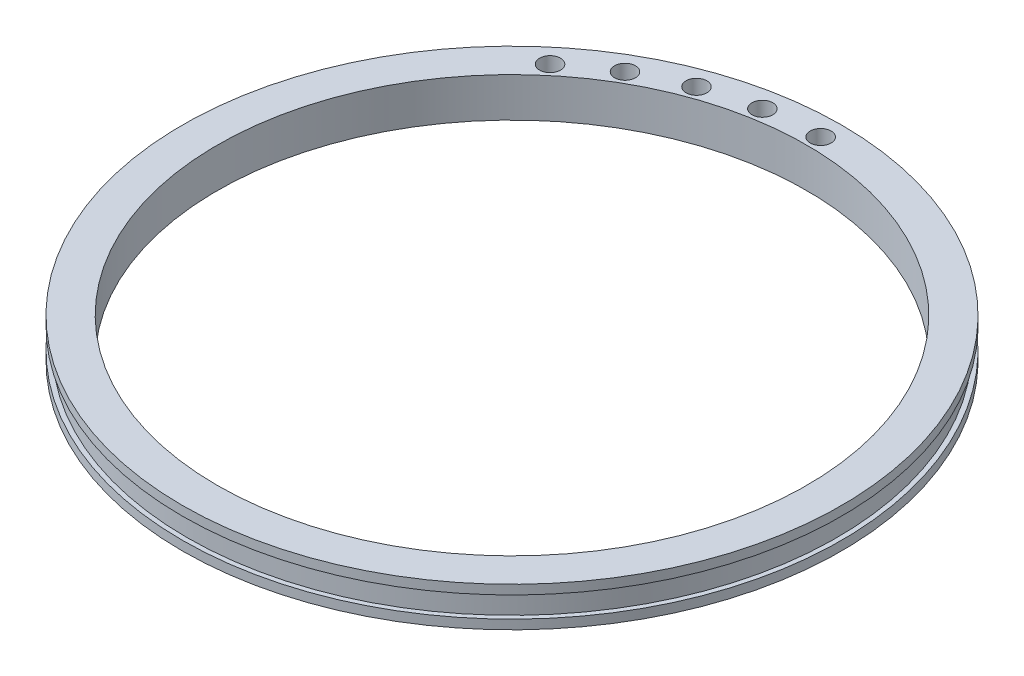
ISO-10303-21;
HEADER;
FILE_DESCRIPTION(('STEP AP214'),'2;1');
FILE_NAME('part.step','',(''),(''),'','','');
FILE_SCHEMA(('AUTOMOTIVE_DESIGN { 1 0 10303 214 1 1 1 1 }'));
ENDSEC;
DATA;
#1=APPLICATION_CONTEXT('core data for automotive mechanical design processes');
#2=APPLICATION_PROTOCOL_DEFINITION('international standard','automotive_design',2000,#1);
#3=PRODUCT_CONTEXT('',#1,'mechanical');
#4=PRODUCT('Part','Part','',(#3));
#5=PRODUCT_RELATED_PRODUCT_CATEGORY('part','',(#4));
#6=PRODUCT_DEFINITION_FORMATION('','',#4);
#7=PRODUCT_DEFINITION_CONTEXT('part definition',#1,'design');
#8=PRODUCT_DEFINITION('design','',#6,#7);
#9=PRODUCT_DEFINITION_SHAPE('','',#8);
#10=(LENGTH_UNIT() NAMED_UNIT(*) SI_UNIT(.MILLI.,.METRE.));
#11=(NAMED_UNIT(*) PLANE_ANGLE_UNIT() SI_UNIT($,.RADIAN.));
#12=(NAMED_UNIT(*) SI_UNIT($,.STERADIAN.) SOLID_ANGLE_UNIT());
#13=UNCERTAINTY_MEASURE_WITH_UNIT(LENGTH_MEASURE(1.E-05),#10,'distance_accuracy_value','');
#14=(GEOMETRIC_REPRESENTATION_CONTEXT(3) GLOBAL_UNCERTAINTY_ASSIGNED_CONTEXT((#13)) GLOBAL_UNIT_ASSIGNED_CONTEXT((#10,
#11,#12)) REPRESENTATION_CONTEXT('',''));
#15=CARTESIAN_POINT('',(0.,0.,0.));
#16=DIRECTION('',(0.,0.,1.));
#17=DIRECTION('',(1.,0.,0.));
#18=AXIS2_PLACEMENT_3D('',#15,#16,#17);
#19=CARTESIAN_POINT('',(0.,2.25,0.));
#20=DIRECTION('',(0.,-1.,0.));
#21=DIRECTION('',(0.,0.,-1.));
#22=AXIS2_PLACEMENT_3D('',#19,#20,#21);
#23=CYLINDRICAL_SURFACE('',#22,70.);
#24=CARTESIAN_POINT('',(0.,2.25,0.));
#25=DIRECTION('',(0.,1.,0.));
#26=DIRECTION('',(0.,0.,1.));
#27=AXIS2_PLACEMENT_3D('',#24,#25,#26);
#28=CIRCLE('',#27,70.);
#29=CARTESIAN_POINT('',(0.,2.25,70.));
#30=VERTEX_POINT('',#29);
#31=EDGE_CURVE('E10',#30,#30,#28,.T.);
#32=ORIENTED_EDGE('',*,*,#31,.F.);
#33=EDGE_LOOP('',(#32));
#34=FACE_BOUND('',#33,.T.);
#35=CARTESIAN_POINT('',(0.,-2.25,0.));
#36=DIRECTION('',(0.,1.,0.));
#37=DIRECTION('',(0.,0.,1.));
#38=AXIS2_PLACEMENT_3D('',#35,#36,#37);
#39=CIRCLE('',#38,70.);
#40=CARTESIAN_POINT('',(0.,-2.25,70.));
#41=VERTEX_POINT('',#40);
#42=EDGE_CURVE('E34',#41,#41,#39,.T.);
#43=ORIENTED_EDGE('',*,*,#42,.T.);
#44=EDGE_LOOP('',(#43));
#45=FACE_BOUND('',#44,.T.);
#46=ADVANCED_FACE('F31',(#34,#45),#23,.T.);
#47=CARTESIAN_POINT('',(0.,4.25,0.));
#48=DIRECTION('',(0.,-1.,0.));
#49=DIRECTION('',(0.,0.,-1.));
#50=AXIS2_PLACEMENT_3D('',#47,#48,#49);
#51=CYLINDRICAL_SURFACE('',#50,71.);
#52=CARTESIAN_POINT('',(0.,4.25,0.));
#53=DIRECTION('',(0.,1.,0.));
#54=DIRECTION('',(0.,0.,1.));
#55=AXIS2_PLACEMENT_3D('',#52,#53,#54);
#56=CIRCLE('',#55,71.);
#57=CARTESIAN_POINT('',(0.,4.25,71.));
#58=VERTEX_POINT('',#57);
#59=EDGE_CURVE('E38',#58,#58,#56,.T.);
#60=ORIENTED_EDGE('',*,*,#59,.F.);
#61=EDGE_LOOP('',(#60));
#62=FACE_BOUND('',#61,.T.);
#63=CARTESIAN_POINT('',(0.,2.25,0.));
#64=DIRECTION('',(0.,1.,0.));
#65=DIRECTION('',(0.,0.,1.));
#66=AXIS2_PLACEMENT_3D('',#63,#64,#65);
#67=CIRCLE('',#66,71.);
#68=CARTESIAN_POINT('',(0.,2.25,71.));
#69=VERTEX_POINT('',#68);
#70=EDGE_CURVE('E42',#69,#69,#67,.T.);
#71=ORIENTED_EDGE('',*,*,#70,.T.);
#72=EDGE_LOOP('',(#71));
#73=FACE_BOUND('',#72,.T.);
#74=ADVANCED_FACE('F96',(#62,#73),#51,.T.);
#75=CARTESIAN_POINT('',(0.,4.25,0.));
#76=DIRECTION('',(0.,1.,0.));
#77=DIRECTION('',(0.,0.,1.));
#78=AXIS2_PLACEMENT_3D('',#75,#76,#77);
#79=PLANE('',#78);
#80=CARTESIAN_POINT('',(-11.5476038148509,4.25,-65.4897155753118));
#81=DIRECTION('',(0.,1.,0.));
#82=DIRECTION('',(0.173648177666931,0.,0.984807753012208));
#83=AXIS2_PLACEMENT_3D('',#80,#81,#82);
#84=CIRCLE('',#83,2.25);
#85=CARTESIAN_POINT('',(-11.1568954151003,4.25,-63.2738981310344));
#86=VERTEX_POINT('',#85);
#87=EDGE_CURVE('E82',#86,#86,#84,.T.);
#88=ORIENTED_EDGE('',*,*,#87,.F.);
#89=EDGE_LOOP('',(#88));
#90=FACE_BOUND('',#89,.T.);
#91=CARTESIAN_POINT('',(-22.744339531157,4.25,-62.4895592822629));
#92=DIRECTION('',(0.,1.,0.));
#93=DIRECTION('',(0.342020143325669,0.,0.939692620785908));
#94=AXIS2_PLACEMENT_3D('',#91,#92,#93);
#95=CIRCLE('',#94,2.25);
#96=CARTESIAN_POINT('',(-21.9747942086743,4.25,-60.3752508854946));
#97=VERTEX_POINT('',#96);
#98=EDGE_CURVE('E76',#97,#97,#95,.T.);
#99=ORIENTED_EDGE('',*,*,#98,.F.);
#100=EDGE_LOOP('',(#99));
#101=FACE_BOUND('',#100,.T.);
#102=CARTESIAN_POINT('',(-33.2500000000001,4.25,-57.5906893516651));
#103=DIRECTION('',(0.,1.,0.));
#104=DIRECTION('',(0.500000000000001,0.,0.866025403784438));
#105=AXIS2_PLACEMENT_3D('',#102,#103,#104);
#106=CIRCLE('',#105,2.25);
#107=CARTESIAN_POINT('',(-32.1250000000001,4.25,-55.6421321931501));
#108=VERTEX_POINT('',#107);
#109=EDGE_CURVE('E69',#108,#108,#106,.T.);
#110=ORIENTED_EDGE('',*,*,#109,.F.);
#111=EDGE_LOOP('',(#110));
#112=FACE_BOUND('',#111,.T.);
#113=CARTESIAN_POINT('',(-42.745376044155,4.25,-50.941955467412));
#114=DIRECTION('',(0.,1.,0.));
#115=DIRECTION('',(0.642787609686541,0.,0.766044443118977));
#116=AXIS2_PLACEMENT_3D('',#113,#114,#115);
#117=CIRCLE('',#116,2.25);
#118=CARTESIAN_POINT('',(-41.2991039223602,4.25,-49.2183554703943));
#119=VERTEX_POINT('',#118);
#120=EDGE_CURVE('E70',#119,#119,#117,.T.);
#121=ORIENTED_EDGE('',*,*,#120,.F.);
#122=EDGE_LOOP('',(#121));
#123=FACE_BOUND('',#122,.T.);
#124=CARTESIAN_POINT('',(0.,4.25,-66.5));
#125=DIRECTION('',(0.,1.,0.));
#126=DIRECTION('',(0.,0.,1.));
#127=AXIS2_PLACEMENT_3D('',#124,#125,#126);
#128=CIRCLE('',#127,2.25);
#129=CARTESIAN_POINT('',(0.,4.25,-64.25));
#130=VERTEX_POINT('',#129);
#131=EDGE_CURVE('E62',#130,#130,#128,.T.);
#132=ORIENTED_EDGE('',*,*,#131,.F.);
#133=EDGE_LOOP('',(#132));
#134=FACE_BOUND('',#133,.T.);
#135=CARTESIAN_POINT('',(0.,4.25,0.));
#136=DIRECTION('',(0.,1.,0.));
#137=DIRECTION('',(0.,0.,1.));
#138=AXIS2_PLACEMENT_3D('',#135,#136,#137);
#139=CIRCLE('',#138,63.5);
#140=CARTESIAN_POINT('',(0.,4.25,63.5));
#141=VERTEX_POINT('',#140);
#142=EDGE_CURVE('E51',#141,#141,#139,.T.);
#143=ORIENTED_EDGE('',*,*,#142,.F.);
#144=EDGE_LOOP('',(#143));
#145=FACE_BOUND('',#144,.T.);
#146=ORIENTED_EDGE('',*,*,#59,.T.);
#147=EDGE_LOOP('',(#146));
#148=FACE_BOUND('',#147,.T.);
#149=ADVANCED_FACE('F92',(#90,#101,#112,#123,#134,#145,#148),#79,.T.);
#150=CARTESIAN_POINT('',(0.,2.25,0.));
#151=DIRECTION('',(0.,1.,0.));
#152=DIRECTION('',(0.,0.,1.));
#153=AXIS2_PLACEMENT_3D('',#150,#151,#152);
#154=PLANE('',#153);
#155=ORIENTED_EDGE('',*,*,#31,.T.);
#156=EDGE_LOOP('',(#155));
#157=FACE_BOUND('',#156,.T.);
#158=ORIENTED_EDGE('',*,*,#70,.F.);
#159=EDGE_LOOP('',(#158));
#160=FACE_BOUND('',#159,.T.);
#161=ADVANCED_FACE('F95',(#157,#160),#154,.F.);
#162=CARTESIAN_POINT('',(0.,-4.25,0.));
#163=DIRECTION('',(0.,1.,0.));
#164=DIRECTION('',(0.,0.,1.));
#165=AXIS2_PLACEMENT_3D('',#162,#163,#164);
#166=CYLINDRICAL_SURFACE('',#165,71.);
#167=CARTESIAN_POINT('',(0.,-4.25,0.));
#168=DIRECTION('',(0.,1.,0.));
#169=DIRECTION('',(0.,0.,1.));
#170=AXIS2_PLACEMENT_3D('',#167,#168,#169);
#171=CIRCLE('',#170,71.);
#172=CARTESIAN_POINT('',(0.,-4.25,71.));
#173=VERTEX_POINT('',#172);
#174=EDGE_CURVE('E50',#173,#173,#171,.T.);
#175=ORIENTED_EDGE('',*,*,#174,.T.);
#176=EDGE_LOOP('',(#175));
#177=FACE_BOUND('',#176,.T.);
#178=CARTESIAN_POINT('',(0.,-2.25,0.));
#179=DIRECTION('',(0.,1.,0.));
#180=DIRECTION('',(0.,0.,1.));
#181=AXIS2_PLACEMENT_3D('',#178,#179,#180);
#182=CIRCLE('',#181,71.);
#183=CARTESIAN_POINT('',(0.,-2.25,71.));
#184=VERTEX_POINT('',#183);
#185=EDGE_CURVE('E47',#184,#184,#182,.T.);
#186=ORIENTED_EDGE('',*,*,#185,.F.);
#187=EDGE_LOOP('',(#186));
#188=FACE_BOUND('',#187,.T.);
#189=ADVANCED_FACE('F115',(#177,#188),#166,.T.);
#190=CARTESIAN_POINT('',(0.,-4.25,0.));
#191=DIRECTION('',(0.,-1.,0.));
#192=DIRECTION('',(0.,0.,1.));
#193=AXIS2_PLACEMENT_3D('',#190,#191,#192);
#194=PLANE('',#193);
#195=CARTESIAN_POINT('',(-11.5476038148509,-4.25,-65.4897155753118));
#196=DIRECTION('',(0.,1.,0.));
#197=DIRECTION('',(0.173648177666931,0.,0.984807753012208));
#198=AXIS2_PLACEMENT_3D('',#195,#196,#197);
#199=CIRCLE('',#198,2.25);
#200=CARTESIAN_POINT('',(-11.1568954151003,-4.25,-63.2738981310344));
#201=VERTEX_POINT('',#200);
#202=EDGE_CURVE('E65',#201,#201,#199,.T.);
#203=ORIENTED_EDGE('',*,*,#202,.T.);
#204=EDGE_LOOP('',(#203));
#205=FACE_BOUND('',#204,.T.);
#206=CARTESIAN_POINT('',(-22.744339531157,-4.25,-62.4895592822629));
#207=DIRECTION('',(0.,1.,0.));
#208=DIRECTION('',(0.342020143325669,0.,0.939692620785908));
#209=AXIS2_PLACEMENT_3D('',#206,#207,#208);
#210=CIRCLE('',#209,2.25);
#211=CARTESIAN_POINT('',(-21.9747942086743,-4.25,-60.3752508854946));
#212=VERTEX_POINT('',#211);
#213=EDGE_CURVE('E79',#212,#212,#210,.T.);
#214=ORIENTED_EDGE('',*,*,#213,.T.);
#215=EDGE_LOOP('',(#214));
#216=FACE_BOUND('',#215,.T.);
#217=CARTESIAN_POINT('',(-33.2500000000001,-4.25,-57.5906893516651));
#218=DIRECTION('',(0.,1.,0.));
#219=DIRECTION('',(0.500000000000001,0.,0.866025403784438));
#220=AXIS2_PLACEMENT_3D('',#217,#218,#219);
#221=CIRCLE('',#220,2.25);
#222=CARTESIAN_POINT('',(-32.1250000000001,-4.25,-55.6421321931501));
#223=VERTEX_POINT('',#222);
#224=EDGE_CURVE('E73',#223,#223,#221,.T.);
#225=ORIENTED_EDGE('',*,*,#224,.T.);
#226=EDGE_LOOP('',(#225));
#227=FACE_BOUND('',#226,.T.);
#228=CARTESIAN_POINT('',(-42.745376044155,-4.25,-50.941955467412));
#229=DIRECTION('',(0.,1.,0.));
#230=DIRECTION('',(0.642787609686541,0.,0.766044443118977));
#231=AXIS2_PLACEMENT_3D('',#228,#229,#230);
#232=CIRCLE('',#231,2.25);
#233=CARTESIAN_POINT('',(-41.2991039223602,-4.25,-49.2183554703943));
#234=VERTEX_POINT('',#233);
#235=EDGE_CURVE('E66',#234,#234,#232,.T.);
#236=ORIENTED_EDGE('',*,*,#235,.T.);
#237=EDGE_LOOP('',(#236));
#238=FACE_BOUND('',#237,.T.);
#239=CARTESIAN_POINT('',(0.,-4.25,-66.5));
#240=DIRECTION('',(0.,1.,0.));
#241=DIRECTION('',(0.,0.,1.));
#242=AXIS2_PLACEMENT_3D('',#239,#240,#241);
#243=CIRCLE('',#242,2.25);
#244=CARTESIAN_POINT('',(0.,-4.25,-64.25));
#245=VERTEX_POINT('',#244);
#246=EDGE_CURVE('E59',#245,#245,#243,.T.);
#247=ORIENTED_EDGE('',*,*,#246,.T.);
#248=EDGE_LOOP('',(#247));
#249=FACE_BOUND('',#248,.T.);
#250=CARTESIAN_POINT('',(0.,-4.25,0.));
#251=DIRECTION('',(0.,1.,0.));
#252=DIRECTION('',(0.,0.,1.));
#253=AXIS2_PLACEMENT_3D('',#250,#251,#252);
#254=CIRCLE('',#253,63.5);
#255=CARTESIAN_POINT('',(0.,-4.25,63.5));
#256=VERTEX_POINT('',#255);
#257=EDGE_CURVE('E56',#256,#256,#254,.T.);
#258=ORIENTED_EDGE('',*,*,#257,.T.);
#259=EDGE_LOOP('',(#258));
#260=FACE_BOUND('',#259,.T.);
#261=ORIENTED_EDGE('',*,*,#174,.F.);
#262=EDGE_LOOP('',(#261));
#263=FACE_BOUND('',#262,.T.);
#264=ADVANCED_FACE('F120',(#205,#216,#227,#238,#249,#260,#263),#194,.T.);
#265=CARTESIAN_POINT('',(0.,-2.25,0.));
#266=DIRECTION('',(0.,-1.,0.));
#267=DIRECTION('',(0.,0.,1.));
#268=AXIS2_PLACEMENT_3D('',#265,#266,#267);
#269=PLANE('',#268);
#270=ORIENTED_EDGE('',*,*,#42,.F.);
#271=EDGE_LOOP('',(#270));
#272=FACE_BOUND('',#271,.T.);
#273=ORIENTED_EDGE('',*,*,#185,.T.);
#274=EDGE_LOOP('',(#273));
#275=FACE_BOUND('',#274,.T.);
#276=ADVANCED_FACE('F131',(#272,#275),#269,.F.);
#277=CARTESIAN_POINT('',(0.,-4.25,0.));
#278=DIRECTION('',(0.,1.,0.));
#279=DIRECTION('',(0.,0.,1.));
#280=AXIS2_PLACEMENT_3D('',#277,#278,#279);
#281=CYLINDRICAL_SURFACE('',#280,63.5);
#282=ORIENTED_EDGE('',*,*,#142,.T.);
#283=EDGE_LOOP('',(#282));
#284=FACE_BOUND('',#283,.T.);
#285=ORIENTED_EDGE('',*,*,#257,.F.);
#286=EDGE_LOOP('',(#285));
#287=FACE_BOUND('',#286,.T.);
#288=ADVANCED_FACE('F134',(#284,#287),#281,.F.);
#289=CARTESIAN_POINT('',(0.,-4.25,-66.5));
#290=DIRECTION('',(0.,1.,0.));
#291=DIRECTION('',(0.,0.,1.));
#292=AXIS2_PLACEMENT_3D('',#289,#290,#291);
#293=CYLINDRICAL_SURFACE('',#292,2.25);
#294=ORIENTED_EDGE('',*,*,#246,.F.);
#295=EDGE_LOOP('',(#294));
#296=FACE_BOUND('',#295,.T.);
#297=ORIENTED_EDGE('',*,*,#131,.T.);
#298=EDGE_LOOP('',(#297));
#299=FACE_BOUND('',#298,.T.);
#300=ADVANCED_FACE('F142',(#296,#299),#293,.F.);
#301=CARTESIAN_POINT('',(-42.745376044155,-4.25,-50.941955467412));
#302=DIRECTION('',(0.,1.,0.));
#303=DIRECTION('',(0.,0.,1.));
#304=AXIS2_PLACEMENT_3D('',#301,#302,#303);
#305=CYLINDRICAL_SURFACE('',#304,2.25);
#306=ORIENTED_EDGE('',*,*,#235,.F.);
#307=EDGE_LOOP('',(#306));
#308=FACE_BOUND('',#307,.T.);
#309=ORIENTED_EDGE('',*,*,#120,.T.);
#310=EDGE_LOOP('',(#309));
#311=FACE_BOUND('',#310,.T.);
#312=ADVANCED_FACE('F150',(#308,#311),#305,.F.);
#313=CARTESIAN_POINT('',(-33.2500000000001,-4.25,-57.5906893516651));
#314=DIRECTION('',(0.,1.,0.));
#315=DIRECTION('',(0.,0.,1.));
#316=AXIS2_PLACEMENT_3D('',#313,#314,#315);
#317=CYLINDRICAL_SURFACE('',#316,2.25);
#318=ORIENTED_EDGE('',*,*,#224,.F.);
#319=EDGE_LOOP('',(#318));
#320=FACE_BOUND('',#319,.T.);
#321=ORIENTED_EDGE('',*,*,#109,.T.);
#322=EDGE_LOOP('',(#321));
#323=FACE_BOUND('',#322,.T.);
#324=ADVANCED_FACE('F154',(#320,#323),#317,.F.);
#325=CARTESIAN_POINT('',(-22.744339531157,-4.25,-62.4895592822629));
#326=DIRECTION('',(0.,1.,0.));
#327=DIRECTION('',(0.,0.,1.));
#328=AXIS2_PLACEMENT_3D('',#325,#326,#327);
#329=CYLINDRICAL_SURFACE('',#328,2.25);
#330=ORIENTED_EDGE('',*,*,#213,.F.);
#331=EDGE_LOOP('',(#330));
#332=FACE_BOUND('',#331,.T.);
#333=ORIENTED_EDGE('',*,*,#98,.T.);
#334=EDGE_LOOP('',(#333));
#335=FACE_BOUND('',#334,.T.);
#336=ADVANCED_FACE('F158',(#332,#335),#329,.F.);
#337=CARTESIAN_POINT('',(-11.5476038148509,-4.25,-65.4897155753118));
#338=DIRECTION('',(0.,1.,0.));
#339=DIRECTION('',(0.,0.,1.));
#340=AXIS2_PLACEMENT_3D('',#337,#338,#339);
#341=CYLINDRICAL_SURFACE('',#340,2.25);
#342=ORIENTED_EDGE('',*,*,#202,.F.);
#343=EDGE_LOOP('',(#342));
#344=FACE_BOUND('',#343,.T.);
#345=ORIENTED_EDGE('',*,*,#87,.T.);
#346=EDGE_LOOP('',(#345));
#347=FACE_BOUND('',#346,.T.);
#348=ADVANCED_FACE('F90',(#344,#347),#341,.F.);
#349=CLOSED_SHELL('',(#46,#74,#149,#161,#189,#264,#276,#288,#300,#312,#324,#336,#348));
#350=MANIFOLD_SOLID_BREP('B2',#349);
#351=ADVANCED_BREP_SHAPE_REPRESENTATION('',(#18,#350),#14);
#352=SHAPE_DEFINITION_REPRESENTATION(#9,#351);
ENDSEC;
END-ISO-10303-21;
